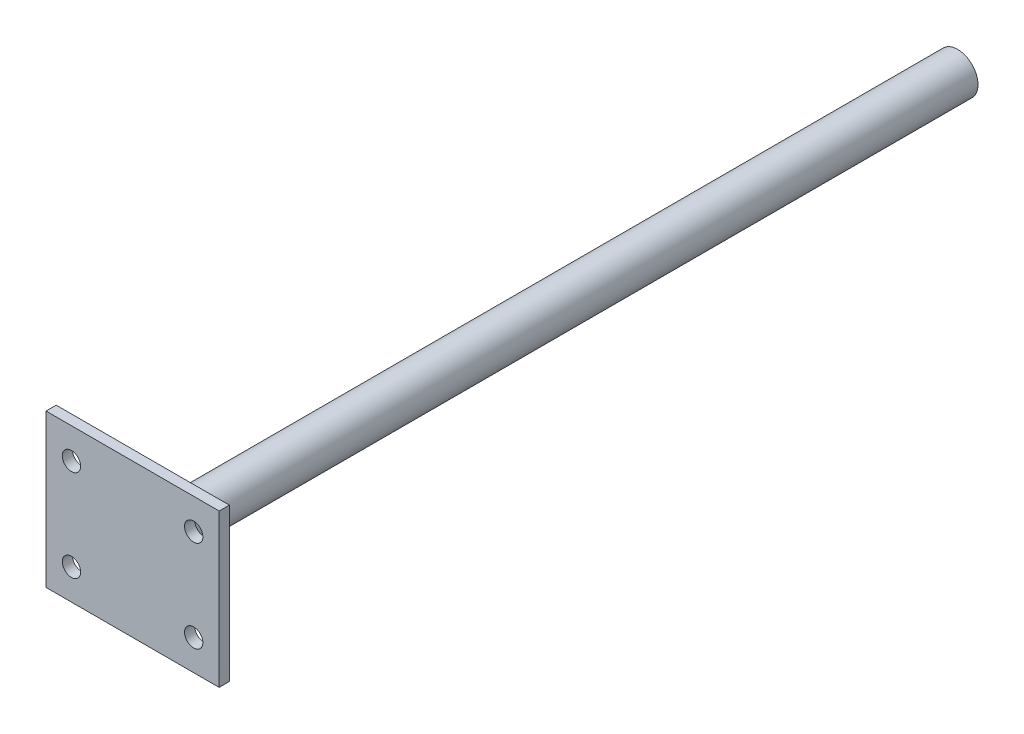
ISO-10303-21;
HEADER;
FILE_DESCRIPTION(('STEP AP214'),'2;1');
FILE_NAME('part.step','',(''),(''),'','','');
FILE_SCHEMA(('AUTOMOTIVE_DESIGN { 1 0 10303 214 1 1 1 1 }'));
ENDSEC;
DATA;
#1=APPLICATION_CONTEXT('core data for automotive mechanical design processes');
#2=APPLICATION_PROTOCOL_DEFINITION('international standard','automotive_design',2000,#1);
#3=PRODUCT_CONTEXT('',#1,'mechanical');
#4=PRODUCT('Part','Part','',(#3));
#5=PRODUCT_RELATED_PRODUCT_CATEGORY('part','',(#4));
#6=PRODUCT_DEFINITION_FORMATION('','',#4);
#7=PRODUCT_DEFINITION_CONTEXT('part definition',#1,'design');
#8=PRODUCT_DEFINITION('design','',#6,#7);
#9=PRODUCT_DEFINITION_SHAPE('','',#8);
#10=(LENGTH_UNIT() NAMED_UNIT(*) SI_UNIT(.MILLI.,.METRE.));
#11=(NAMED_UNIT(*) PLANE_ANGLE_UNIT() SI_UNIT($,.RADIAN.));
#12=(NAMED_UNIT(*) SI_UNIT($,.STERADIAN.) SOLID_ANGLE_UNIT());
#13=UNCERTAINTY_MEASURE_WITH_UNIT(LENGTH_MEASURE(1.E-05),#10,'distance_accuracy_value','');
#14=(GEOMETRIC_REPRESENTATION_CONTEXT(3) GLOBAL_UNCERTAINTY_ASSIGNED_CONTEXT((#13)) GLOBAL_UNIT_ASSIGNED_CONTEXT((#10,
#11,#12)) REPRESENTATION_CONTEXT('',''));
#15=CARTESIAN_POINT('',(0.,0.,0.));
#16=DIRECTION('',(0.,0.,1.));
#17=DIRECTION('',(1.,0.,0.));
#18=AXIS2_PLACEMENT_3D('',#15,#16,#17);
#19=CARTESIAN_POINT('',(0.,0.,2.25));
#20=DIRECTION('',(0.,0.,1.));
#21=DIRECTION('',(1.,0.,0.));
#22=AXIS2_PLACEMENT_3D('',#19,#20,#21);
#23=PLANE('',#22);
#24=CARTESIAN_POINT('',(15.,-11.25,2.25));
#25=DIRECTION('',(0.,0.,1.));
#26=DIRECTION('',(1.,0.,0.));
#27=AXIS2_PLACEMENT_3D('',#24,#25,#26);
#28=CIRCLE('',#27,2.25);
#29=CARTESIAN_POINT('',(17.25,-11.25,2.25));
#30=VERTEX_POINT('',#29);
#31=EDGE_CURVE('E180',#30,#30,#28,.T.);
#32=ORIENTED_EDGE('',*,*,#31,.F.);
#33=EDGE_LOOP('',(#32));
#34=FACE_BOUND('',#33,.T.);
#35=CARTESIAN_POINT('',(-15.,11.25,2.25));
#36=DIRECTION('',(0.,0.,1.));
#37=DIRECTION('',(1.,0.,0.));
#38=AXIS2_PLACEMENT_3D('',#35,#36,#37);
#39=CIRCLE('',#38,2.25);
#40=CARTESIAN_POINT('',(-12.75,11.25,2.25));
#41=VERTEX_POINT('',#40);
#42=EDGE_CURVE('E106',#41,#41,#39,.T.);
#43=ORIENTED_EDGE('',*,*,#42,.F.);
#44=EDGE_LOOP('',(#43));
#45=FACE_BOUND('',#44,.T.);
#46=DIRECTION('',(0.,1.,0.));
#47=VECTOR('',#46,1.);
#48=CARTESIAN_POINT('',(21.25,18.75,2.25));
#49=LINE('',#48,#47);
#50=CARTESIAN_POINT('',(21.25,-18.75,2.25));
#51=VERTEX_POINT('',#50);
#52=CARTESIAN_POINT('',(21.25,18.75,2.25));
#53=VERTEX_POINT('',#52);
#54=EDGE_CURVE('E88',#51,#53,#49,.T.);
#55=ORIENTED_EDGE('',*,*,#54,.T.);
#56=DIRECTION('',(-1.,0.,0.));
#57=VECTOR('',#56,1.);
#58=CARTESIAN_POINT('',(-21.25,18.75,2.25));
#59=LINE('',#58,#57);
#60=CARTESIAN_POINT('',(-21.25,18.75,2.25));
#61=VERTEX_POINT('',#60);
#62=EDGE_CURVE('E83',#53,#61,#59,.T.);
#63=ORIENTED_EDGE('',*,*,#62,.T.);
#64=DIRECTION('',(0.,-1.,0.));
#65=VECTOR('',#64,1.);
#66=CARTESIAN_POINT('',(-21.25,18.75,2.25));
#67=LINE('',#66,#65);
#68=CARTESIAN_POINT('',(-21.25,-18.75,2.25));
#69=VERTEX_POINT('',#68);
#70=EDGE_CURVE('E86',#61,#69,#67,.T.);
#71=ORIENTED_EDGE('',*,*,#70,.T.);
#72=DIRECTION('',(1.,0.,0.));
#73=VECTOR('',#72,1.);
#74=CARTESIAN_POINT('',(-21.25,-18.75,2.25));
#75=LINE('',#74,#73);
#76=EDGE_CURVE('E52',#69,#51,#75,.T.);
#77=ORIENTED_EDGE('',*,*,#76,.T.);
#78=EDGE_LOOP('',(#55,#63,#71,#77));
#79=FACE_BOUND('',#78,.T.);
#80=CARTESIAN_POINT('',(15.,11.25,2.25));
#81=DIRECTION('',(0.,0.,1.));
#82=DIRECTION('',(-1.,0.,0.));
#83=AXIS2_PLACEMENT_3D('',#80,#81,#82);
#84=CIRCLE('',#83,2.25);
#85=CARTESIAN_POINT('',(12.75,11.25,2.25));
#86=VERTEX_POINT('',#85);
#87=EDGE_CURVE('E184',#86,#86,#84,.T.);
#88=ORIENTED_EDGE('',*,*,#87,.F.);
#89=EDGE_LOOP('',(#88));
#90=FACE_BOUND('',#89,.T.);
#91=CARTESIAN_POINT('',(-15.,-11.25,2.25));
#92=DIRECTION('',(0.,0.,1.));
#93=DIRECTION('',(-1.,0.,0.));
#94=AXIS2_PLACEMENT_3D('',#91,#92,#93);
#95=CIRCLE('',#94,2.25);
#96=CARTESIAN_POINT('',(-17.25,-11.25,2.25));
#97=VERTEX_POINT('',#96);
#98=EDGE_CURVE('E172',#97,#97,#95,.T.);
#99=ORIENTED_EDGE('',*,*,#98,.F.);
#100=EDGE_LOOP('',(#99));
#101=FACE_BOUND('',#100,.T.);
#102=ADVANCED_FACE('F35',(#34,#45,#79,#90,#101),#23,.T.);
#103=CARTESIAN_POINT('',(0.,0.,-0.25));
#104=DIRECTION('',(0.,0.,1.));
#105=DIRECTION('',(1.,0.,0.));
#106=AXIS2_PLACEMENT_3D('',#103,#104,#105);
#107=PLANE('',#106);
#108=CARTESIAN_POINT('',(0.,0.,-0.25));
#109=DIRECTION('',(0.,0.,1.));
#110=DIRECTION('',(1.,0.,0.));
#111=AXIS2_PLACEMENT_3D('',#108,#109,#110);
#112=CIRCLE('',#111,7.);
#113=CARTESIAN_POINT('',(7.,0.,-0.25));
#114=VERTEX_POINT('',#113);
#115=EDGE_CURVE('E11',#114,#114,#112,.T.);
#116=ORIENTED_EDGE('',*,*,#115,.T.);
#117=EDGE_LOOP('',(#116));
#118=FACE_BOUND('',#117,.T.);
#119=DIRECTION('',(0.,1.,0.));
#120=VECTOR('',#119,1.);
#121=CARTESIAN_POINT('',(21.25,18.75,-0.25));
#122=LINE('',#121,#120);
#123=CARTESIAN_POINT('',(21.25,-18.75,-0.25));
#124=VERTEX_POINT('',#123);
#125=CARTESIAN_POINT('',(21.25,18.75,-0.25));
#126=VERTEX_POINT('',#125);
#127=EDGE_CURVE('E103',#124,#126,#122,.T.);
#128=ORIENTED_EDGE('',*,*,#127,.F.);
#129=DIRECTION('',(1.,0.,0.));
#130=VECTOR('',#129,1.);
#131=CARTESIAN_POINT('',(-21.25,-18.75,-0.25));
#132=LINE('',#131,#130);
#133=CARTESIAN_POINT('',(-21.25,-18.75,-0.25));
#134=VERTEX_POINT('',#133);
#135=EDGE_CURVE('E75',#134,#124,#132,.T.);
#136=ORIENTED_EDGE('',*,*,#135,.F.);
#137=DIRECTION('',(0.,-1.,0.));
#138=VECTOR('',#137,1.);
#139=CARTESIAN_POINT('',(-21.25,18.75,-0.25));
#140=LINE('',#139,#138);
#141=CARTESIAN_POINT('',(-21.25,18.75,-0.25));
#142=VERTEX_POINT('',#141);
#143=EDGE_CURVE('E69',#142,#134,#140,.T.);
#144=ORIENTED_EDGE('',*,*,#143,.F.);
#145=DIRECTION('',(-1.,0.,0.));
#146=VECTOR('',#145,1.);
#147=CARTESIAN_POINT('',(-21.25,18.75,-0.25));
#148=LINE('',#147,#146);
#149=EDGE_CURVE('E93',#126,#142,#148,.T.);
#150=ORIENTED_EDGE('',*,*,#149,.F.);
#151=EDGE_LOOP('',(#128,#136,#144,#150));
#152=FACE_BOUND('',#151,.T.);
#153=CARTESIAN_POINT('',(-15.,11.25,-0.25));
#154=DIRECTION('',(0.,0.,1.));
#155=DIRECTION('',(1.,0.,0.));
#156=AXIS2_PLACEMENT_3D('',#153,#154,#155);
#157=CIRCLE('',#156,2.25);
#158=CARTESIAN_POINT('',(-12.75,11.25,-0.25));
#159=VERTEX_POINT('',#158);
#160=EDGE_CURVE('E159',#159,#159,#157,.T.);
#161=ORIENTED_EDGE('',*,*,#160,.T.);
#162=EDGE_LOOP('',(#161));
#163=FACE_BOUND('',#162,.T.);
#164=CARTESIAN_POINT('',(15.,11.25,-0.25));
#165=DIRECTION('',(0.,0.,1.));
#166=DIRECTION('',(-1.,0.,0.));
#167=AXIS2_PLACEMENT_3D('',#164,#165,#166);
#168=CIRCLE('',#167,2.25);
#169=CARTESIAN_POINT('',(12.75,11.25,-0.25));
#170=VERTEX_POINT('',#169);
#171=EDGE_CURVE('E163',#170,#170,#168,.T.);
#172=ORIENTED_EDGE('',*,*,#171,.T.);
#173=EDGE_LOOP('',(#172));
#174=FACE_BOUND('',#173,.T.);
#175=CARTESIAN_POINT('',(15.,-11.25,-0.25));
#176=DIRECTION('',(0.,0.,1.));
#177=DIRECTION('',(1.,0.,0.));
#178=AXIS2_PLACEMENT_3D('',#175,#176,#177);
#179=CIRCLE('',#178,2.25);
#180=CARTESIAN_POINT('',(17.25,-11.25,-0.25));
#181=VERTEX_POINT('',#180);
#182=EDGE_CURVE('E167',#181,#181,#179,.T.);
#183=ORIENTED_EDGE('',*,*,#182,.T.);
#184=EDGE_LOOP('',(#183));
#185=FACE_BOUND('',#184,.T.);
#186=CARTESIAN_POINT('',(-15.,-11.25,-0.25));
#187=DIRECTION('',(0.,0.,1.));
#188=DIRECTION('',(-1.,0.,0.));
#189=AXIS2_PLACEMENT_3D('',#186,#187,#188);
#190=CIRCLE('',#189,2.25);
#191=CARTESIAN_POINT('',(-17.25,-11.25,-0.25));
#192=VERTEX_POINT('',#191);
#193=EDGE_CURVE('E170',#192,#192,#190,.T.);
#194=ORIENTED_EDGE('',*,*,#193,.T.);
#195=EDGE_LOOP('',(#194));
#196=FACE_BOUND('',#195,.T.);
#197=ADVANCED_FACE('F128',(#118,#152,#163,#174,#185,#196),#107,.F.);
#198=CARTESIAN_POINT('',(21.25,18.75,2.25));
#199=DIRECTION('',(-1.,0.,0.));
#200=DIRECTION('',(0.,-1.,0.));
#201=AXIS2_PLACEMENT_3D('',#198,#199,#200);
#202=PLANE('',#201);
#203=ORIENTED_EDGE('',*,*,#127,.T.);
#204=DIRECTION('',(0.,0.,-1.));
#205=VECTOR('',#204,1.);
#206=CARTESIAN_POINT('',(21.25,18.75,2.25));
#207=LINE('',#206,#205);
#208=EDGE_CURVE('E94',#53,#126,#207,.T.);
#209=ORIENTED_EDGE('',*,*,#208,.F.);
#210=ORIENTED_EDGE('',*,*,#54,.F.);
#211=DIRECTION('',(0.,0.,-1.));
#212=VECTOR('',#211,1.);
#213=CARTESIAN_POINT('',(21.25,-18.75,2.25));
#214=LINE('',#213,#212);
#215=EDGE_CURVE('E99',#51,#124,#214,.T.);
#216=ORIENTED_EDGE('',*,*,#215,.T.);
#217=EDGE_LOOP('',(#203,#209,#210,#216));
#218=FACE_BOUND('',#217,.T.);
#219=ADVANCED_FACE('F134',(#218),#202,.F.);
#220=CARTESIAN_POINT('',(-21.25,18.75,2.25));
#221=DIRECTION('',(0.,-1.,0.));
#222=DIRECTION('',(0.,0.,-1.));
#223=AXIS2_PLACEMENT_3D('',#220,#221,#222);
#224=PLANE('',#223);
#225=ORIENTED_EDGE('',*,*,#149,.T.);
#226=DIRECTION('',(0.,0.,-1.));
#227=VECTOR('',#226,1.);
#228=CARTESIAN_POINT('',(-21.25,18.75,2.25));
#229=LINE('',#228,#227);
#230=EDGE_CURVE('E91',#61,#142,#229,.T.);
#231=ORIENTED_EDGE('',*,*,#230,.F.);
#232=ORIENTED_EDGE('',*,*,#62,.F.);
#233=ORIENTED_EDGE('',*,*,#208,.T.);
#234=EDGE_LOOP('',(#225,#231,#232,#233));
#235=FACE_BOUND('',#234,.T.);
#236=ADVANCED_FACE('F92',(#235),#224,.F.);
#237=CARTESIAN_POINT('',(-21.25,18.75,2.25));
#238=DIRECTION('',(1.,0.,0.));
#239=DIRECTION('',(0.,1.,0.));
#240=AXIS2_PLACEMENT_3D('',#237,#238,#239);
#241=PLANE('',#240);
#242=ORIENTED_EDGE('',*,*,#143,.T.);
#243=DIRECTION('',(0.,0.,-1.));
#244=VECTOR('',#243,1.);
#245=CARTESIAN_POINT('',(-21.25,-18.75,2.25));
#246=LINE('',#245,#244);
#247=EDGE_CURVE('E95',#69,#134,#246,.T.);
#248=ORIENTED_EDGE('',*,*,#247,.F.);
#249=ORIENTED_EDGE('',*,*,#70,.F.);
#250=ORIENTED_EDGE('',*,*,#230,.T.);
#251=EDGE_LOOP('',(#242,#248,#249,#250));
#252=FACE_BOUND('',#251,.T.);
#253=ADVANCED_FACE('F97',(#252),#241,.F.);
#254=CARTESIAN_POINT('',(-21.25,-18.75,2.25));
#255=DIRECTION('',(0.,1.,0.));
#256=DIRECTION('',(0.,0.,1.));
#257=AXIS2_PLACEMENT_3D('',#254,#255,#256);
#258=PLANE('',#257);
#259=ORIENTED_EDGE('',*,*,#135,.T.);
#260=ORIENTED_EDGE('',*,*,#215,.F.);
#261=ORIENTED_EDGE('',*,*,#76,.F.);
#262=ORIENTED_EDGE('',*,*,#247,.T.);
#263=EDGE_LOOP('',(#259,#260,#261,#262));
#264=FACE_BOUND('',#263,.T.);
#265=ADVANCED_FACE('F143',(#264),#258,.F.);
#266=CARTESIAN_POINT('',(-15.,11.25,2.25));
#267=DIRECTION('',(0.,0.,-1.));
#268=DIRECTION('',(-1.,0.,0.));
#269=AXIS2_PLACEMENT_3D('',#266,#267,#268);
#270=CYLINDRICAL_SURFACE('',#269,2.25);
#271=ORIENTED_EDGE('',*,*,#42,.T.);
#272=EDGE_LOOP('',(#271));
#273=FACE_BOUND('',#272,.T.);
#274=ORIENTED_EDGE('',*,*,#160,.F.);
#275=EDGE_LOOP('',(#274));
#276=FACE_BOUND('',#275,.T.);
#277=ADVANCED_FACE('F140',(#273,#276),#270,.F.);
#278=CARTESIAN_POINT('',(15.,11.25,2.25));
#279=DIRECTION('',(0.,0.,-1.));
#280=DIRECTION('',(-1.,0.,0.));
#281=AXIS2_PLACEMENT_3D('',#278,#279,#280);
#282=CYLINDRICAL_SURFACE('',#281,2.25);
#283=ORIENTED_EDGE('',*,*,#87,.T.);
#284=EDGE_LOOP('',(#283));
#285=FACE_BOUND('',#284,.T.);
#286=ORIENTED_EDGE('',*,*,#171,.F.);
#287=EDGE_LOOP('',(#286));
#288=FACE_BOUND('',#287,.T.);
#289=ADVANCED_FACE('F194',(#285,#288),#282,.F.);
#290=CARTESIAN_POINT('',(15.,-11.25,2.25));
#291=DIRECTION('',(0.,0.,-1.));
#292=DIRECTION('',(-1.,0.,0.));
#293=AXIS2_PLACEMENT_3D('',#290,#291,#292);
#294=CYLINDRICAL_SURFACE('',#293,2.25);
#295=ORIENTED_EDGE('',*,*,#31,.T.);
#296=EDGE_LOOP('',(#295));
#297=FACE_BOUND('',#296,.T.);
#298=ORIENTED_EDGE('',*,*,#182,.F.);
#299=EDGE_LOOP('',(#298));
#300=FACE_BOUND('',#299,.T.);
#301=ADVANCED_FACE('F198',(#297,#300),#294,.F.);
#302=CARTESIAN_POINT('',(-15.,-11.25,2.25));
#303=DIRECTION('',(0.,0.,-1.));
#304=DIRECTION('',(-1.,0.,0.));
#305=AXIS2_PLACEMENT_3D('',#302,#303,#304);
#306=CYLINDRICAL_SURFACE('',#305,2.25);
#307=ORIENTED_EDGE('',*,*,#98,.T.);
#308=EDGE_LOOP('',(#307));
#309=FACE_BOUND('',#308,.T.);
#310=ORIENTED_EDGE('',*,*,#193,.F.);
#311=EDGE_LOOP('',(#310));
#312=FACE_BOUND('',#311,.T.);
#313=ADVANCED_FACE('F203',(#309,#312),#306,.F.);
#314=CARTESIAN_POINT('',(0.,0.,-200.25));
#315=DIRECTION('',(0.,0.,1.));
#316=DIRECTION('',(1.,0.,0.));
#317=AXIS2_PLACEMENT_3D('',#314,#315,#316);
#318=CYLINDRICAL_SURFACE('',#317,5.);
#319=CARTESIAN_POINT('',(0.,0.,-2.25));
#320=DIRECTION('',(0.,0.,1.));
#321=DIRECTION('',(1.,0.,0.));
#322=AXIS2_PLACEMENT_3D('',#319,#320,#321);
#323=CIRCLE('',#322,5.);
#324=CARTESIAN_POINT('',(5.,0.,-2.25));
#325=VERTEX_POINT('',#324);
#326=EDGE_CURVE('E44',#325,#325,#323,.F.);
#327=ORIENTED_EDGE('',*,*,#326,.T.);
#328=EDGE_LOOP('',(#327));
#329=FACE_BOUND('',#328,.T.);
#330=CARTESIAN_POINT('',(0.,0.,-200.25));
#331=DIRECTION('',(0.,0.,-1.));
#332=DIRECTION('',(-1.,0.,0.));
#333=AXIS2_PLACEMENT_3D('',#330,#331,#332);
#334=CIRCLE('',#333,5.);
#335=CARTESIAN_POINT('',(-5.,0.,-200.25));
#336=VERTEX_POINT('',#335);
#337=EDGE_CURVE('E173',#336,#336,#334,.T.);
#338=ORIENTED_EDGE('',*,*,#337,.F.);
#339=EDGE_LOOP('',(#338));
#340=FACE_BOUND('',#339,.T.);
#341=ADVANCED_FACE('F115',(#329,#340),#318,.T.);
#342=CARTESIAN_POINT('',(0.,0.,-200.25));
#343=DIRECTION('',(0.,0.,-1.));
#344=DIRECTION('',(-1.,0.,0.));
#345=AXIS2_PLACEMENT_3D('',#342,#343,#344);
#346=PLANE('',#345);
#347=ORIENTED_EDGE('',*,*,#337,.T.);
#348=EDGE_LOOP('',(#347));
#349=FACE_BOUND('',#348,.T.);
#350=ADVANCED_FACE('F119',(#349),#346,.T.);
#351=CARTESIAN_POINT('',(0.,0.,-2.25));
#352=DIRECTION('',(0.,0.,1.));
#353=DIRECTION('',(1.,0.,0.));
#354=AXIS2_PLACEMENT_3D('',#351,#352,#353);
#355=TOROIDAL_SURFACE('',#354,7.,2.);
#356=ORIENTED_EDGE('',*,*,#115,.F.);
#357=EDGE_LOOP('',(#356));
#358=FACE_BOUND('',#357,.T.);
#359=ORIENTED_EDGE('',*,*,#326,.F.);
#360=EDGE_LOOP('',(#359));
#361=FACE_BOUND('',#360,.T.);
#362=ADVANCED_FACE('F37',(#358,#361),#355,.F.);
#363=CLOSED_SHELL('',(#102,#197,#219,#236,#253,#265,#277,#289,#301,#313,#341,#350,#362));
#364=MANIFOLD_SOLID_BREP('B2',#363);
#365=ADVANCED_BREP_SHAPE_REPRESENTATION('',(#18,#364),#14);
#366=SHAPE_DEFINITION_REPRESENTATION(#9,#365);
ENDSEC;
END-ISO-10303-21;
